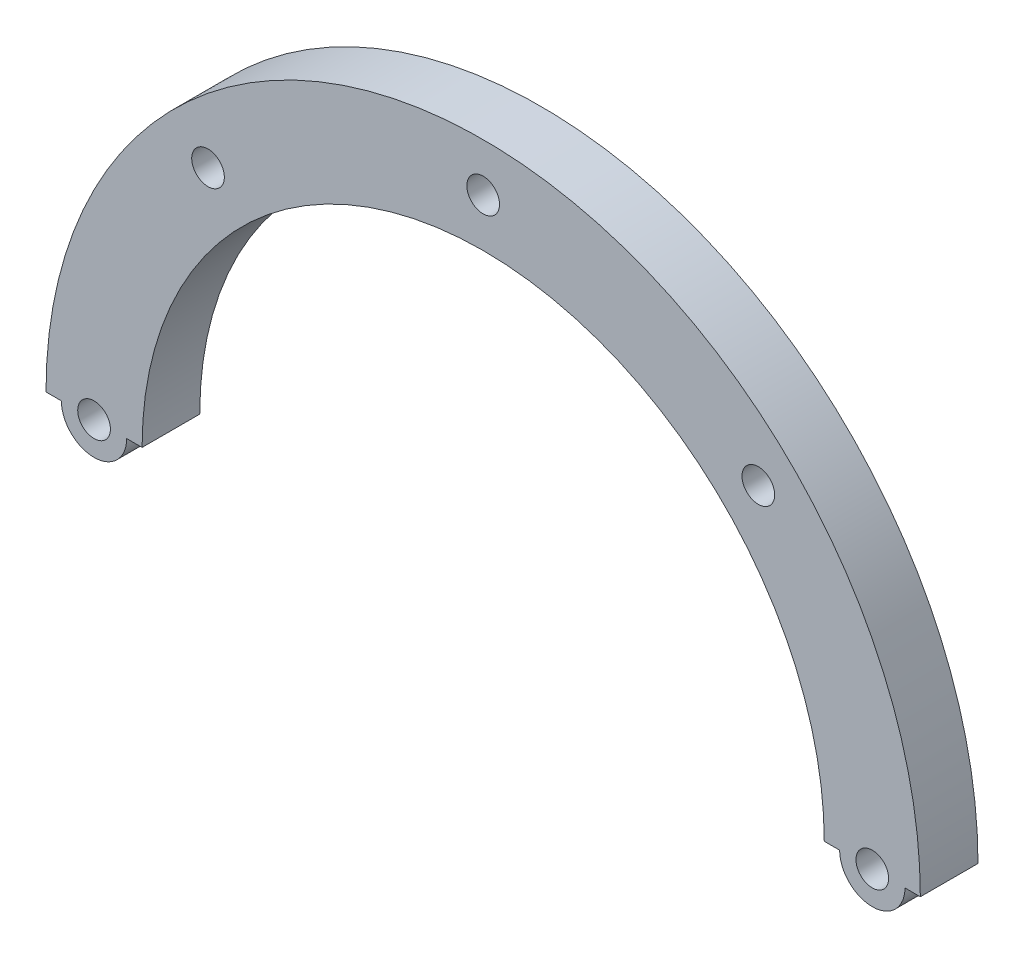
ISO-10303-21;
HEADER;
FILE_DESCRIPTION(('STEP AP214'),'2;1');
FILE_NAME('part.step','',(''),(''),'','','');
FILE_SCHEMA(('AUTOMOTIVE_DESIGN { 1 0 10303 214 1 1 1 1 }'));
ENDSEC;
DATA;
#1=APPLICATION_CONTEXT('core data for automotive mechanical design processes');
#2=APPLICATION_PROTOCOL_DEFINITION('international standard','automotive_design',2000,#1);
#3=PRODUCT_CONTEXT('',#1,'mechanical');
#4=PRODUCT('Part','Part','',(#3));
#5=PRODUCT_RELATED_PRODUCT_CATEGORY('part','',(#4));
#6=PRODUCT_DEFINITION_FORMATION('','',#4);
#7=PRODUCT_DEFINITION_CONTEXT('part definition',#1,'design');
#8=PRODUCT_DEFINITION('design','',#6,#7);
#9=PRODUCT_DEFINITION_SHAPE('','',#8);
#10=(LENGTH_UNIT() NAMED_UNIT(*) SI_UNIT(.MILLI.,.METRE.));
#11=(NAMED_UNIT(*) PLANE_ANGLE_UNIT() SI_UNIT($,.RADIAN.));
#12=(NAMED_UNIT(*) SI_UNIT($,.STERADIAN.) SOLID_ANGLE_UNIT());
#13=UNCERTAINTY_MEASURE_WITH_UNIT(LENGTH_MEASURE(1.E-05),#10,'distance_accuracy_value','');
#14=(GEOMETRIC_REPRESENTATION_CONTEXT(3) GLOBAL_UNCERTAINTY_ASSIGNED_CONTEXT((#13)) GLOBAL_UNIT_ASSIGNED_CONTEXT((#10,
#11,#12)) REPRESENTATION_CONTEXT('',''));
#15=CARTESIAN_POINT('',(0.,0.,0.));
#16=DIRECTION('',(0.,0.,1.));
#17=DIRECTION('',(1.,0.,0.));
#18=AXIS2_PLACEMENT_3D('',#15,#16,#17);
#19=CARTESIAN_POINT('',(-45.5,0.,6.));
#20=DIRECTION('',(0.,1.,0.));
#21=DIRECTION('',(0.,0.,1.));
#22=AXIS2_PLACEMENT_3D('',#19,#20,#21);
#23=PLANE('',#22);
#24=DIRECTION('',(1.,0.,0.));
#25=VECTOR('',#24,1.);
#26=CARTESIAN_POINT('',(-45.5,0.,0.));
#27=LINE('',#26,#25);
#28=CARTESIAN_POINT('',(-45.5,0.,0.));
#29=VERTEX_POINT('',#28);
#30=CARTESIAN_POINT('',(-43.9000000000029,0.,0.));
#31=VERTEX_POINT('',#30);
#32=EDGE_CURVE('E175',#29,#31,#27,.T.);
#33=ORIENTED_EDGE('',*,*,#32,.T.);
#34=DIRECTION('',(0.,0.,1.));
#35=VECTOR('',#34,1.);
#36=CARTESIAN_POINT('',(-43.9000000000029,0.,-9.61665222413705));
#37=LINE('',#36,#35);
#38=CARTESIAN_POINT('',(-43.9000000000029,0.,6.));
#39=VERTEX_POINT('',#38);
#40=EDGE_CURVE('E132',#31,#39,#37,.T.);
#41=ORIENTED_EDGE('',*,*,#40,.T.);
#42=DIRECTION('',(1.,0.,0.));
#43=VECTOR('',#42,1.);
#44=CARTESIAN_POINT('',(-45.5,0.,6.));
#45=LINE('',#44,#43);
#46=CARTESIAN_POINT('',(-45.5,0.,6.));
#47=VERTEX_POINT('',#46);
#48=EDGE_CURVE('E165',#47,#39,#45,.T.);
#49=ORIENTED_EDGE('',*,*,#48,.F.);
#50=DIRECTION('',(0.,0.,-1.));
#51=VECTOR('',#50,1.);
#52=CARTESIAN_POINT('',(-45.5,0.,6.));
#53=LINE('',#52,#51);
#54=EDGE_CURVE('E41',#47,#29,#53,.T.);
#55=ORIENTED_EDGE('',*,*,#54,.T.);
#56=EDGE_LOOP('',(#33,#41,#49,#55));
#57=FACE_BOUND('',#56,.T.);
#58=ADVANCED_FACE('F33',(#57),#23,.F.);
#59=CARTESIAN_POINT('',(35.5,0.,6.));
#60=DIRECTION('',(0.,1.,0.));
#61=DIRECTION('',(0.,0.,1.));
#62=AXIS2_PLACEMENT_3D('',#59,#60,#61);
#63=PLANE('',#62);
#64=DIRECTION('',(1.,0.,0.));
#65=VECTOR('',#64,1.);
#66=CARTESIAN_POINT('',(35.5,0.,0.));
#67=LINE('',#66,#65);
#68=CARTESIAN_POINT('',(35.5,0.,0.));
#69=VERTEX_POINT('',#68);
#70=CARTESIAN_POINT('',(37.1000000000029,0.,0.));
#71=VERTEX_POINT('',#70);
#72=EDGE_CURVE('E108',#69,#71,#67,.T.);
#73=ORIENTED_EDGE('',*,*,#72,.T.);
#74=DIRECTION('',(0.,0.,1.));
#75=VECTOR('',#74,1.);
#76=CARTESIAN_POINT('',(37.1000000000029,0.,-9.61665222413705));
#77=LINE('',#76,#75);
#78=CARTESIAN_POINT('',(37.1000000000029,0.,6.));
#79=VERTEX_POINT('',#78);
#80=EDGE_CURVE('E56',#71,#79,#77,.T.);
#81=ORIENTED_EDGE('',*,*,#80,.T.);
#82=DIRECTION('',(1.,0.,0.));
#83=VECTOR('',#82,1.);
#84=CARTESIAN_POINT('',(35.5,0.,6.));
#85=LINE('',#84,#83);
#86=CARTESIAN_POINT('',(35.5,0.,6.));
#87=VERTEX_POINT('',#86);
#88=EDGE_CURVE('E170',#87,#79,#85,.T.);
#89=ORIENTED_EDGE('',*,*,#88,.F.);
#90=DIRECTION('',(0.,0.,-1.));
#91=VECTOR('',#90,1.);
#92=CARTESIAN_POINT('',(35.5,0.,6.));
#93=LINE('',#92,#91);
#94=EDGE_CURVE('E179',#87,#69,#93,.T.);
#95=ORIENTED_EDGE('',*,*,#94,.T.);
#96=EDGE_LOOP('',(#73,#81,#89,#95));
#97=FACE_BOUND('',#96,.T.);
#98=ADVANCED_FACE('F196',(#97),#63,.F.);
#99=CARTESIAN_POINT('',(0.,0.,6.));
#100=DIRECTION('',(0.,0.,-1.));
#101=DIRECTION('',(-1.,0.,0.));
#102=AXIS2_PLACEMENT_3D('',#99,#100,#101);
#103=CYLINDRICAL_SURFACE('',#102,45.5);
#104=CARTESIAN_POINT('',(0.,0.,0.));
#105=DIRECTION('',(0.,0.,1.));
#106=DIRECTION('',(1.,0.,0.));
#107=AXIS2_PLACEMENT_3D('',#104,#105,#106);
#108=CIRCLE('',#107,45.5);
#109=CARTESIAN_POINT('',(45.5,0.,0.));
#110=VERTEX_POINT('',#109);
#111=EDGE_CURVE('E106',#110,#29,#108,.T.);
#112=ORIENTED_EDGE('',*,*,#111,.T.);
#113=ORIENTED_EDGE('',*,*,#54,.F.);
#114=CARTESIAN_POINT('',(0.,0.,6.));
#115=DIRECTION('',(0.,0.,1.));
#116=DIRECTION('',(1.,0.,0.));
#117=AXIS2_PLACEMENT_3D('',#114,#115,#116);
#118=CIRCLE('',#117,45.5);
#119=CARTESIAN_POINT('',(45.5,0.,6.));
#120=VERTEX_POINT('',#119);
#121=EDGE_CURVE('E161',#120,#47,#118,.T.);
#122=ORIENTED_EDGE('',*,*,#121,.F.);
#123=DIRECTION('',(0.,0.,-1.));
#124=VECTOR('',#123,1.);
#125=CARTESIAN_POINT('',(45.5,0.,6.));
#126=LINE('',#125,#124);
#127=EDGE_CURVE('E172',#120,#110,#126,.T.);
#128=ORIENTED_EDGE('',*,*,#127,.T.);
#129=EDGE_LOOP('',(#112,#113,#122,#128));
#130=FACE_BOUND('',#129,.T.);
#131=ADVANCED_FACE('F35',(#130),#103,.T.);
#132=CARTESIAN_POINT('',(-37.1000000000029,0.,6.));
#133=VERTEX_POINT('',#132);
#134=CARTESIAN_POINT('',(-35.5,0.,6.));
#135=VERTEX_POINT('',#134);
#136=EDGE_CURVE('E164',#133,#135,#45,.T.);
#137=ORIENTED_EDGE('',*,*,#136,.F.);
#138=DIRECTION('',(0.,0.,1.));
#139=VECTOR('',#138,1.);
#140=CARTESIAN_POINT('',(-37.1000000000029,0.,-9.61665222413705));
#141=LINE('',#140,#139);
#142=CARTESIAN_POINT('',(-37.1000000000029,0.,0.));
#143=VERTEX_POINT('',#142);
#144=EDGE_CURVE('E127',#133,#143,#141,.F.);
#145=ORIENTED_EDGE('',*,*,#144,.T.);
#146=CARTESIAN_POINT('',(-35.5,0.,0.));
#147=VERTEX_POINT('',#146);
#148=EDGE_CURVE('E174',#143,#147,#27,.T.);
#149=ORIENTED_EDGE('',*,*,#148,.T.);
#150=DIRECTION('',(0.,0.,-1.));
#151=VECTOR('',#150,1.);
#152=CARTESIAN_POINT('',(-35.5,0.,6.));
#153=LINE('',#152,#151);
#154=EDGE_CURVE('E182',#135,#147,#153,.T.);
#155=ORIENTED_EDGE('',*,*,#154,.F.);
#156=EDGE_LOOP('',(#137,#145,#149,#155));
#157=FACE_BOUND('',#156,.T.);
#158=ADVANCED_FACE('F202',(#157),#23,.F.);
#159=CARTESIAN_POINT('',(0.,0.,6.));
#160=DIRECTION('',(0.,0.,-1.));
#161=DIRECTION('',(-1.,0.,0.));
#162=AXIS2_PLACEMENT_3D('',#159,#160,#161);
#163=CYLINDRICAL_SURFACE('',#162,35.5);
#164=CARTESIAN_POINT('',(0.,0.,0.));
#165=DIRECTION('',(0.,0.,-1.));
#166=DIRECTION('',(1.,0.,0.));
#167=AXIS2_PLACEMENT_3D('',#164,#165,#166);
#168=CIRCLE('',#167,35.5);
#169=EDGE_CURVE('E109',#147,#69,#168,.T.);
#170=ORIENTED_EDGE('',*,*,#169,.T.);
#171=ORIENTED_EDGE('',*,*,#94,.F.);
#172=CARTESIAN_POINT('',(0.,0.,6.));
#173=DIRECTION('',(0.,0.,-1.));
#174=DIRECTION('',(1.,0.,0.));
#175=AXIS2_PLACEMENT_3D('',#172,#173,#174);
#176=CIRCLE('',#175,35.5);
#177=EDGE_CURVE('E168',#135,#87,#176,.T.);
#178=ORIENTED_EDGE('',*,*,#177,.F.);
#179=ORIENTED_EDGE('',*,*,#154,.T.);
#180=EDGE_LOOP('',(#170,#171,#178,#179));
#181=FACE_BOUND('',#180,.T.);
#182=ADVANCED_FACE('F199',(#181),#163,.F.);
#183=CARTESIAN_POINT('',(43.9000000000029,0.,6.));
#184=VERTEX_POINT('',#183);
#185=EDGE_CURVE('E48',#184,#120,#85,.T.);
#186=ORIENTED_EDGE('',*,*,#185,.F.);
#187=DIRECTION('',(0.,0.,1.));
#188=VECTOR('',#187,1.);
#189=CARTESIAN_POINT('',(43.9000000000029,0.,-9.61665222413705));
#190=LINE('',#189,#188);
#191=CARTESIAN_POINT('',(43.9000000000029,0.,0.));
#192=VERTEX_POINT('',#191);
#193=EDGE_CURVE('E111',#184,#192,#190,.F.);
#194=ORIENTED_EDGE('',*,*,#193,.T.);
#195=EDGE_CURVE('E100',#192,#110,#67,.T.);
#196=ORIENTED_EDGE('',*,*,#195,.T.);
#197=ORIENTED_EDGE('',*,*,#127,.F.);
#198=EDGE_LOOP('',(#186,#194,#196,#197));
#199=FACE_BOUND('',#198,.T.);
#200=ADVANCED_FACE('F112',(#199),#63,.F.);
#201=CARTESIAN_POINT('',(0.,0.,6.));
#202=DIRECTION('',(0.,0.,1.));
#203=DIRECTION('',(1.,0.,0.));
#204=AXIS2_PLACEMENT_3D('',#201,#202,#203);
#205=PLANE('',#204);
#206=ORIENTED_EDGE('',*,*,#88,.T.);
#207=CARTESIAN_POINT('',(40.5000000000029,1.05619134740018E-12,6.));
#208=DIRECTION('',(0.,0.,1.));
#209=DIRECTION('',(-1.,0.,0.));
#210=AXIS2_PLACEMENT_3D('',#207,#208,#209);
#211=CIRCLE('',#210,3.4);
#212=EDGE_CURVE('E118',#79,#184,#211,.T.);
#213=ORIENTED_EDGE('',*,*,#212,.T.);
#214=ORIENTED_EDGE('',*,*,#185,.T.);
#215=ORIENTED_EDGE('',*,*,#121,.T.);
#216=ORIENTED_EDGE('',*,*,#48,.T.);
#217=CARTESIAN_POINT('',(-40.5000000000029,1.05619134740018E-12,6.));
#218=DIRECTION('',(0.,0.,1.));
#219=DIRECTION('',(1.,0.,0.));
#220=AXIS2_PLACEMENT_3D('',#217,#218,#219);
#221=CIRCLE('',#220,3.4);
#222=EDGE_CURVE('E123',#39,#133,#221,.T.);
#223=ORIENTED_EDGE('',*,*,#222,.T.);
#224=ORIENTED_EDGE('',*,*,#136,.T.);
#225=ORIENTED_EDGE('',*,*,#177,.T.);
#226=EDGE_LOOP('',(#206,#213,#214,#215,#216,#223,#224,#225));
#227=FACE_BOUND('',#226,.T.);
#228=CARTESIAN_POINT('',(40.5000000000029,1.05619134740018E-12,6.));
#229=DIRECTION('',(0.,0.,1.));
#230=DIRECTION('',(1.,0.,0.));
#231=AXIS2_PLACEMENT_3D('',#228,#229,#230);
#232=CIRCLE('',#231,1.70000000000031);
#233=CARTESIAN_POINT('',(42.2000000000032,1.05619134740018E-12,6.));
#234=VERTEX_POINT('',#233);
#235=EDGE_CURVE('E146',#234,#234,#232,.T.);
#236=ORIENTED_EDGE('',*,*,#235,.F.);
#237=EDGE_LOOP('',(#236));
#238=FACE_BOUND('',#237,.T.);
#239=CARTESIAN_POINT('',(-40.5000000000029,1.05619134740018E-12,6.));
#240=DIRECTION('',(0.,0.,1.));
#241=DIRECTION('',(-1.,0.,0.));
#242=AXIS2_PLACEMENT_3D('',#239,#240,#241);
#243=CIRCLE('',#242,1.70000000000031);
#244=CARTESIAN_POINT('',(-42.2000000000032,1.05619134740018E-12,6.));
#245=VERTEX_POINT('',#244);
#246=EDGE_CURVE('E141',#245,#245,#243,.T.);
#247=ORIENTED_EDGE('',*,*,#246,.F.);
#248=EDGE_LOOP('',(#247));
#249=FACE_BOUND('',#248,.T.);
#250=CARTESIAN_POINT('',(0.,40.5,6.));
#251=DIRECTION('',(0.,0.,1.));
#252=DIRECTION('',(1.,0.,0.));
#253=AXIS2_PLACEMENT_3D('',#250,#251,#252);
#254=CIRCLE('',#253,1.7);
#255=CARTESIAN_POINT('',(1.7,40.5,6.));
#256=VERTEX_POINT('',#255);
#257=EDGE_CURVE('E138',#256,#256,#254,.T.);
#258=ORIENTED_EDGE('',*,*,#257,.F.);
#259=EDGE_LOOP('',(#258));
#260=FACE_BOUND('',#259,.T.);
#261=CARTESIAN_POINT('',(-28.6378246380567,28.6378246380566,6.));
#262=DIRECTION('',(0.,0.,1.));
#263=DIRECTION('',(-1.,0.,0.));
#264=AXIS2_PLACEMENT_3D('',#261,#262,#263);
#265=CIRCLE('',#264,1.69999999999942);
#266=CARTESIAN_POINT('',(-30.3378246380561,28.6378246380566,6.));
#267=VERTEX_POINT('',#266);
#268=EDGE_CURVE('E134',#267,#267,#265,.T.);
#269=ORIENTED_EDGE('',*,*,#268,.F.);
#270=EDGE_LOOP('',(#269));
#271=FACE_BOUND('',#270,.T.);
#272=CARTESIAN_POINT('',(28.6378246380567,28.6378246380566,6.));
#273=DIRECTION('',(0.,0.,1.));
#274=DIRECTION('',(1.,0.,0.));
#275=AXIS2_PLACEMENT_3D('',#272,#273,#274);
#276=CIRCLE('',#275,1.69999999999942);
#277=CARTESIAN_POINT('',(30.3378246380561,28.6378246380566,6.));
#278=VERTEX_POINT('',#277);
#279=EDGE_CURVE('E145',#278,#278,#276,.T.);
#280=ORIENTED_EDGE('',*,*,#279,.F.);
#281=EDGE_LOOP('',(#280));
#282=FACE_BOUND('',#281,.T.);
#283=ADVANCED_FACE('F191',(#227,#238,#249,#260,#271,#282),#205,.T.);
#284=CARTESIAN_POINT('',(0.,0.,0.));
#285=DIRECTION('',(0.,0.,1.));
#286=DIRECTION('',(1.,0.,0.));
#287=AXIS2_PLACEMENT_3D('',#284,#285,#286);
#288=PLANE('',#287);
#289=CARTESIAN_POINT('',(40.5000000000029,1.05619134740018E-12,0.));
#290=DIRECTION('',(0.,0.,1.));
#291=DIRECTION('',(1.,0.,0.));
#292=AXIS2_PLACEMENT_3D('',#289,#290,#291);
#293=CIRCLE('',#292,1.70000000000031);
#294=CARTESIAN_POINT('',(42.2000000000032,1.05619134740018E-12,0.));
#295=VERTEX_POINT('',#294);
#296=EDGE_CURVE('E142',#295,#295,#293,.T.);
#297=ORIENTED_EDGE('',*,*,#296,.T.);
#298=EDGE_LOOP('',(#297));
#299=FACE_BOUND('',#298,.T.);
#300=CARTESIAN_POINT('',(-40.5000000000029,1.05619134740018E-12,0.));
#301=DIRECTION('',(0.,0.,1.));
#302=DIRECTION('',(1.,0.,0.));
#303=AXIS2_PLACEMENT_3D('',#300,#301,#302);
#304=CIRCLE('',#303,1.70000000000031);
#305=CARTESIAN_POINT('',(-38.8000000000026,1.05619134740018E-12,0.));
#306=VERTEX_POINT('',#305);
#307=EDGE_CURVE('E11',#306,#306,#304,.T.);
#308=ORIENTED_EDGE('',*,*,#307,.T.);
#309=EDGE_LOOP('',(#308));
#310=FACE_BOUND('',#309,.T.);
#311=CARTESIAN_POINT('',(0.,40.5,0.));
#312=DIRECTION('',(0.,0.,1.));
#313=DIRECTION('',(1.,0.,0.));
#314=AXIS2_PLACEMENT_3D('',#311,#312,#313);
#315=CIRCLE('',#314,1.7);
#316=CARTESIAN_POINT('',(1.7,40.5,0.));
#317=VERTEX_POINT('',#316);
#318=EDGE_CURVE('E135',#317,#317,#315,.T.);
#319=ORIENTED_EDGE('',*,*,#318,.T.);
#320=EDGE_LOOP('',(#319));
#321=FACE_BOUND('',#320,.T.);
#322=CARTESIAN_POINT('',(-28.6378246380567,28.6378246380566,0.));
#323=DIRECTION('',(0.,0.,1.));
#324=DIRECTION('',(-1.,0.,0.));
#325=AXIS2_PLACEMENT_3D('',#322,#323,#324);
#326=CIRCLE('',#325,1.69999999999942);
#327=CARTESIAN_POINT('',(-30.3378246380561,28.6378246380566,0.));
#328=VERTEX_POINT('',#327);
#329=EDGE_CURVE('E149',#328,#328,#326,.T.);
#330=ORIENTED_EDGE('',*,*,#329,.T.);
#331=EDGE_LOOP('',(#330));
#332=FACE_BOUND('',#331,.T.);
#333=CARTESIAN_POINT('',(28.6378246380567,28.6378246380566,0.));
#334=DIRECTION('',(0.,0.,1.));
#335=DIRECTION('',(1.,0.,0.));
#336=AXIS2_PLACEMENT_3D('',#333,#334,#335);
#337=CIRCLE('',#336,1.69999999999942);
#338=CARTESIAN_POINT('',(30.3378246380561,28.6378246380566,0.));
#339=VERTEX_POINT('',#338);
#340=EDGE_CURVE('E156',#339,#339,#337,.T.);
#341=ORIENTED_EDGE('',*,*,#340,.T.);
#342=EDGE_LOOP('',(#341));
#343=FACE_BOUND('',#342,.T.);
#344=ORIENTED_EDGE('',*,*,#195,.F.);
#345=CARTESIAN_POINT('',(40.5000000000029,1.05619134740018E-12,0.));
#346=DIRECTION('',(0.,0.,1.));
#347=DIRECTION('',(1.,0.,0.));
#348=AXIS2_PLACEMENT_3D('',#345,#346,#347);
#349=CIRCLE('',#348,3.4);
#350=EDGE_CURVE('E104',#192,#71,#349,.F.);
#351=ORIENTED_EDGE('',*,*,#350,.T.);
#352=ORIENTED_EDGE('',*,*,#72,.F.);
#353=ORIENTED_EDGE('',*,*,#169,.F.);
#354=ORIENTED_EDGE('',*,*,#148,.F.);
#355=CARTESIAN_POINT('',(-40.5000000000029,1.05619134740018E-12,0.));
#356=DIRECTION('',(0.,0.,1.));
#357=DIRECTION('',(1.,0.,0.));
#358=AXIS2_PLACEMENT_3D('',#355,#356,#357);
#359=CIRCLE('',#358,3.4);
#360=EDGE_CURVE('E124',#143,#31,#359,.F.);
#361=ORIENTED_EDGE('',*,*,#360,.T.);
#362=ORIENTED_EDGE('',*,*,#32,.F.);
#363=ORIENTED_EDGE('',*,*,#111,.F.);
#364=EDGE_LOOP('',(#344,#351,#352,#353,#354,#361,#362,#363));
#365=FACE_BOUND('',#364,.T.);
#366=ADVANCED_FACE('F101',(#299,#310,#321,#332,#343,#365),#288,.F.);
#367=CARTESIAN_POINT('',(-40.5000000000029,1.05619134740018E-12,0.));
#368=DIRECTION('',(0.,0.,1.));
#369=DIRECTION('',(1.,0.,0.));
#370=AXIS2_PLACEMENT_3D('',#367,#368,#369);
#371=CYLINDRICAL_SURFACE('',#370,1.70000000000031);
#372=ORIENTED_EDGE('',*,*,#246,.T.);
#373=EDGE_LOOP('',(#372));
#374=FACE_BOUND('',#373,.T.);
#375=ORIENTED_EDGE('',*,*,#307,.F.);
#376=EDGE_LOOP('',(#375));
#377=FACE_BOUND('',#376,.T.);
#378=ADVANCED_FACE('F272',(#374,#377),#371,.F.);
#379=CARTESIAN_POINT('',(28.6378246380567,28.6378246380566,0.));
#380=DIRECTION('',(0.,0.,1.));
#381=DIRECTION('',(1.,0.,0.));
#382=AXIS2_PLACEMENT_3D('',#379,#380,#381);
#383=CYLINDRICAL_SURFACE('',#382,1.69999999999942);
#384=ORIENTED_EDGE('',*,*,#340,.F.);
#385=EDGE_LOOP('',(#384));
#386=FACE_BOUND('',#385,.T.);
#387=ORIENTED_EDGE('',*,*,#279,.T.);
#388=EDGE_LOOP('',(#387));
#389=FACE_BOUND('',#388,.T.);
#390=ADVANCED_FACE('F282',(#386,#389),#383,.F.);
#391=CARTESIAN_POINT('',(40.5000000000029,1.05619134740018E-12,0.));
#392=DIRECTION('',(0.,0.,1.));
#393=DIRECTION('',(1.,0.,0.));
#394=AXIS2_PLACEMENT_3D('',#391,#392,#393);
#395=CYLINDRICAL_SURFACE('',#394,1.70000000000031);
#396=ORIENTED_EDGE('',*,*,#235,.T.);
#397=EDGE_LOOP('',(#396));
#398=FACE_BOUND('',#397,.T.);
#399=ORIENTED_EDGE('',*,*,#296,.F.);
#400=EDGE_LOOP('',(#399));
#401=FACE_BOUND('',#400,.T.);
#402=ADVANCED_FACE('F291',(#398,#401),#395,.F.);
#403=CARTESIAN_POINT('',(-28.6378246380567,28.6378246380566,0.));
#404=DIRECTION('',(0.,0.,1.));
#405=DIRECTION('',(1.,0.,0.));
#406=AXIS2_PLACEMENT_3D('',#403,#404,#405);
#407=CYLINDRICAL_SURFACE('',#406,1.69999999999942);
#408=ORIENTED_EDGE('',*,*,#329,.F.);
#409=EDGE_LOOP('',(#408));
#410=FACE_BOUND('',#409,.T.);
#411=ORIENTED_EDGE('',*,*,#268,.T.);
#412=EDGE_LOOP('',(#411));
#413=FACE_BOUND('',#412,.T.);
#414=ADVANCED_FACE('F215',(#410,#413),#407,.F.);
#415=CARTESIAN_POINT('',(0.,40.5,0.));
#416=DIRECTION('',(0.,0.,1.));
#417=DIRECTION('',(1.,0.,0.));
#418=AXIS2_PLACEMENT_3D('',#415,#416,#417);
#419=CYLINDRICAL_SURFACE('',#418,1.7);
#420=ORIENTED_EDGE('',*,*,#318,.F.);
#421=EDGE_LOOP('',(#420));
#422=FACE_BOUND('',#421,.T.);
#423=ORIENTED_EDGE('',*,*,#257,.T.);
#424=EDGE_LOOP('',(#423));
#425=FACE_BOUND('',#424,.T.);
#426=ADVANCED_FACE('F208',(#422,#425),#419,.F.);
#427=CARTESIAN_POINT('',(-40.5000000000029,1.05619134740018E-12,-9.61665222413705));
#428=DIRECTION('',(0.,0.,1.));
#429=DIRECTION('',(1.,0.,0.));
#430=AXIS2_PLACEMENT_3D('',#427,#428,#429);
#431=CYLINDRICAL_SURFACE('',#430,3.4);
#432=ORIENTED_EDGE('',*,*,#40,.F.);
#433=ORIENTED_EDGE('',*,*,#360,.F.);
#434=ORIENTED_EDGE('',*,*,#144,.F.);
#435=ORIENTED_EDGE('',*,*,#222,.F.);
#436=EDGE_LOOP('',(#432,#433,#434,#435));
#437=FACE_BOUND('',#436,.T.);
#438=ADVANCED_FACE('F206',(#437),#431,.T.);
#439=CARTESIAN_POINT('',(40.5000000000029,1.05619134740018E-12,-9.61665222413705));
#440=DIRECTION('',(0.,0.,1.));
#441=DIRECTION('',(1.,0.,0.));
#442=AXIS2_PLACEMENT_3D('',#439,#440,#441);
#443=CYLINDRICAL_SURFACE('',#442,3.4);
#444=ORIENTED_EDGE('',*,*,#80,.F.);
#445=ORIENTED_EDGE('',*,*,#350,.F.);
#446=ORIENTED_EDGE('',*,*,#193,.F.);
#447=ORIENTED_EDGE('',*,*,#212,.F.);
#448=EDGE_LOOP('',(#444,#445,#446,#447));
#449=FACE_BOUND('',#448,.T.);
#450=ADVANCED_FACE('F117',(#449),#443,.T.);
#451=CLOSED_SHELL('',(#58,#98,#131,#158,#182,#200,#283,#366,#378,#390,#402,#414,#426,#438,#450));
#452=MANIFOLD_SOLID_BREP('B2',#451);
#453=ADVANCED_BREP_SHAPE_REPRESENTATION('',(#18,#452),#14);
#454=SHAPE_DEFINITION_REPRESENTATION(#9,#453);
ENDSEC;
END-ISO-10303-21;
